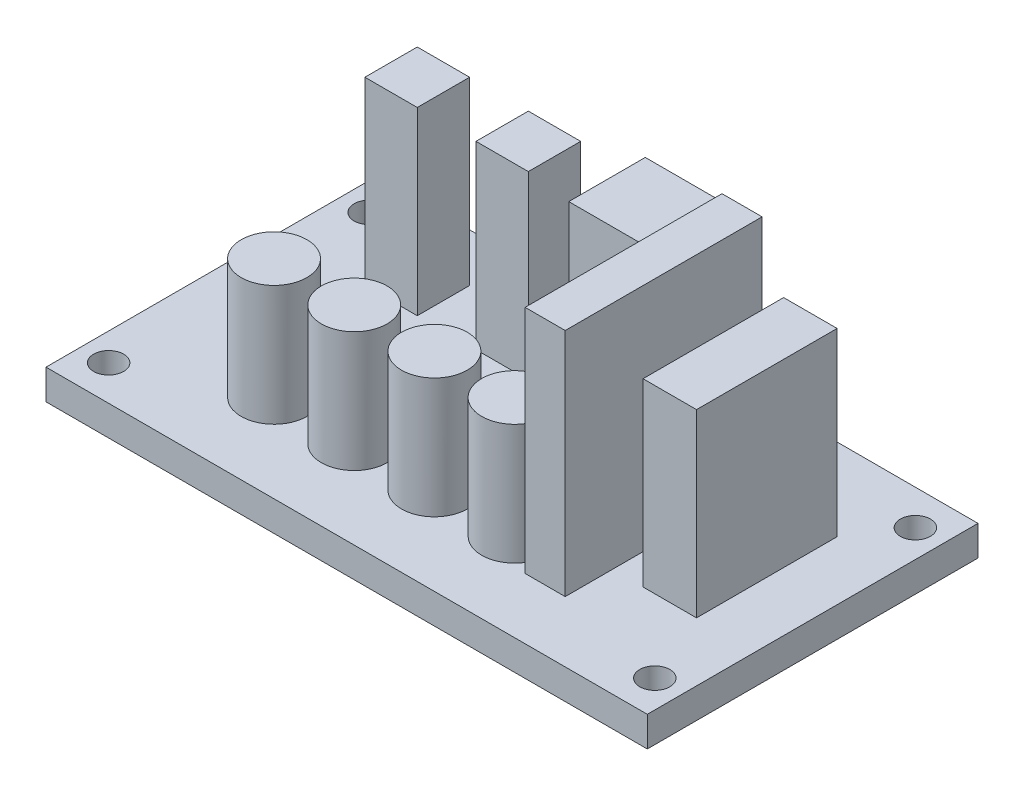
ISO-10303-21;
HEADER;
FILE_DESCRIPTION(('STEP AP214'),'2;1');
FILE_NAME('part.step','',(''),(''),'','','');
FILE_SCHEMA(('AUTOMOTIVE_DESIGN { 1 0 10303 214 1 1 1 1 }'));
ENDSEC;
DATA;
#1=APPLICATION_CONTEXT('core data for automotive mechanical design processes');
#2=APPLICATION_PROTOCOL_DEFINITION('international standard','automotive_design',2000,#1);
#3=PRODUCT_CONTEXT('',#1,'mechanical');
#4=PRODUCT('Part','Part','',(#3));
#5=PRODUCT_RELATED_PRODUCT_CATEGORY('part','',(#4));
#6=PRODUCT_DEFINITION_FORMATION('','',#4);
#7=PRODUCT_DEFINITION_CONTEXT('part definition',#1,'design');
#8=PRODUCT_DEFINITION('design','',#6,#7);
#9=PRODUCT_DEFINITION_SHAPE('','',#8);
#10=(LENGTH_UNIT() NAMED_UNIT(*) SI_UNIT(.MILLI.,.METRE.));
#11=(NAMED_UNIT(*) PLANE_ANGLE_UNIT() SI_UNIT($,.RADIAN.));
#12=(NAMED_UNIT(*) SI_UNIT($,.STERADIAN.) SOLID_ANGLE_UNIT());
#13=UNCERTAINTY_MEASURE_WITH_UNIT(LENGTH_MEASURE(1.E-05),#10,'distance_accuracy_value','');
#14=(GEOMETRIC_REPRESENTATION_CONTEXT(3) GLOBAL_UNCERTAINTY_ASSIGNED_CONTEXT((#13)) GLOBAL_UNIT_ASSIGNED_CONTEXT((#10,
#11,#12)) REPRESENTATION_CONTEXT('',''));
#15=CARTESIAN_POINT('',(0.,0.,0.));
#16=DIRECTION('',(0.,0.,1.));
#17=DIRECTION('',(1.,0.,0.));
#18=AXIS2_PLACEMENT_3D('',#15,#16,#17);
#19=CARTESIAN_POINT('',(0.,3.,-33.));
#20=DIRECTION('',(0.,-1.,0.));
#21=DIRECTION('',(0.,0.,-1.));
#22=AXIS2_PLACEMENT_3D('',#19,#20,#21);
#23=PLANE('',#22);
#24=CARTESIAN_POINT('',(38.,3.,-8.75676326373309));
#25=DIRECTION('',(0.,-1.,0.));
#26=DIRECTION('',(0.,0.,-1.));
#27=AXIS2_PLACEMENT_3D('',#24,#25,#26);
#28=CIRCLE('',#27,3.27908034810426);
#29=CARTESIAN_POINT('',(38.,3.,-12.0358436118374));
#30=VERTEX_POINT('',#29);
#31=EDGE_CURVE('E11',#30,#30,#28,.F.);
#32=ORIENTED_EDGE('',*,*,#31,.F.);
#33=EDGE_LOOP('',(#32));
#34=FACE_BOUND('',#33,.T.);
#35=CARTESIAN_POINT('',(22.,3.,-8.75676326373309));
#36=DIRECTION('',(0.,-1.,0.));
#37=DIRECTION('',(0.,0.,-1.));
#38=AXIS2_PLACEMENT_3D('',#35,#36,#37);
#39=CIRCLE('',#38,3.27908034810427);
#40=CARTESIAN_POINT('',(22.,3.,-12.0358436118374));
#41=VERTEX_POINT('',#40);
#42=EDGE_CURVE('E418',#41,#41,#39,.F.);
#43=ORIENTED_EDGE('',*,*,#42,.F.);
#44=EDGE_LOOP('',(#43));
#45=FACE_BOUND('',#44,.T.);
#46=DIRECTION('',(0.,0.,1.));
#47=VECTOR('',#46,1.);
#48=CARTESIAN_POINT('',(19.9399820026374,3.,-28.1893330684113));
#49=LINE('',#48,#47);
#50=CARTESIAN_POINT('',(19.9399820026374,3.,-28.1893330684113));
#51=VERTEX_POINT('',#50);
#52=CARTESIAN_POINT('',(19.9399820026374,3.,-22.96497794012));
#53=VERTEX_POINT('',#52);
#54=EDGE_CURVE('E229',#51,#53,#49,.T.);
#55=ORIENTED_EDGE('',*,*,#54,.F.);
#56=DIRECTION('',(-1.,0.,0.));
#57=VECTOR('',#56,1.);
#58=CARTESIAN_POINT('',(19.9399820026374,3.,-28.1893330684113));
#59=LINE('',#58,#57);
#60=CARTESIAN_POINT('',(25.1643371309287,3.,-28.1893330684113));
#61=VERTEX_POINT('',#60);
#62=EDGE_CURVE('E234',#61,#51,#59,.T.);
#63=ORIENTED_EDGE('',*,*,#62,.F.);
#64=DIRECTION('',(0.,0.,-1.));
#65=VECTOR('',#64,1.);
#66=CARTESIAN_POINT('',(25.1643371309287,3.,-28.1893330684113));
#67=LINE('',#66,#65);
#68=CARTESIAN_POINT('',(25.1643371309287,3.,-22.96497794012));
#69=VERTEX_POINT('',#68);
#70=EDGE_CURVE('E246',#69,#61,#67,.T.);
#71=ORIENTED_EDGE('',*,*,#70,.F.);
#72=DIRECTION('',(1.,0.,0.));
#73=VECTOR('',#72,1.);
#74=CARTESIAN_POINT('',(19.9399820026374,3.,-22.96497794012));
#75=LINE('',#74,#73);
#76=EDGE_CURVE('E243',#53,#69,#75,.T.);
#77=ORIENTED_EDGE('',*,*,#76,.F.);
#78=EDGE_LOOP('',(#55,#63,#71,#77));
#79=FACE_BOUND('',#78,.T.);
#80=DIRECTION('',(0.,0.,1.));
#81=VECTOR('',#80,1.);
#82=CARTESIAN_POINT('',(48.7885103903238,3.,-24.8147061126076));
#83=LINE('',#82,#81);
#84=CARTESIAN_POINT('',(48.7885103903238,3.,-24.8147061126076));
#85=VERTEX_POINT('',#84);
#86=CARTESIAN_POINT('',(48.7885103903238,3.,-10.7874044385108));
#87=VERTEX_POINT('',#86);
#88=EDGE_CURVE('E295',#85,#87,#83,.T.);
#89=ORIENTED_EDGE('',*,*,#88,.F.);
#90=DIRECTION('',(-1.,0.,0.));
#91=VECTOR('',#90,1.);
#92=CARTESIAN_POINT('',(48.7885103903238,3.,-24.8147061126076));
#93=LINE('',#92,#91);
#94=CARTESIAN_POINT('',(54.1262633456281,3.,-24.8147061126076));
#95=VERTEX_POINT('',#94);
#96=EDGE_CURVE('E300',#95,#85,#93,.T.);
#97=ORIENTED_EDGE('',*,*,#96,.F.);
#98=DIRECTION('',(0.,0.,-1.));
#99=VECTOR('',#98,1.);
#100=CARTESIAN_POINT('',(54.1262633456281,3.,-24.8147061126076));
#101=LINE('',#100,#99);
#102=CARTESIAN_POINT('',(54.1262633456281,3.,-10.7874044385108));
#103=VERTEX_POINT('',#102);
#104=EDGE_CURVE('E312',#103,#95,#101,.T.);
#105=ORIENTED_EDGE('',*,*,#104,.F.);
#106=DIRECTION('',(1.,0.,0.));
#107=VECTOR('',#106,1.);
#108=CARTESIAN_POINT('',(48.7885103903238,3.,-10.7874044385108));
#109=LINE('',#108,#107);
#110=EDGE_CURVE('E309',#87,#103,#109,.T.);
#111=ORIENTED_EDGE('',*,*,#110,.F.);
#112=EDGE_LOOP('',(#89,#97,#105,#111));
#113=FACE_BOUND('',#112,.T.);
#114=CARTESIAN_POINT('',(2.75,3.,-3.5));
#115=DIRECTION('',(0.,1.,0.));
#116=DIRECTION('',(0.,0.,-1.));
#117=AXIS2_PLACEMENT_3D('',#114,#115,#116);
#118=CIRCLE('',#117,1.5);
#119=CARTESIAN_POINT('',(2.75,3.,-5.));
#120=VERTEX_POINT('',#119);
#121=EDGE_CURVE('E362',#120,#120,#118,.T.);
#122=ORIENTED_EDGE('',*,*,#121,.F.);
#123=EDGE_LOOP('',(#122));
#124=FACE_BOUND('',#123,.T.);
#125=CARTESIAN_POINT('',(57.25,3.,-29.5));
#126=DIRECTION('',(0.,1.,0.));
#127=DIRECTION('',(0.,0.,-1.));
#128=AXIS2_PLACEMENT_3D('',#125,#126,#127);
#129=CIRCLE('',#128,1.5);
#130=CARTESIAN_POINT('',(57.25,3.,-31.));
#131=VERTEX_POINT('',#130);
#132=EDGE_CURVE('E374',#131,#131,#129,.T.);
#133=ORIENTED_EDGE('',*,*,#132,.F.);
#134=EDGE_LOOP('',(#133));
#135=FACE_BOUND('',#134,.T.);
#136=DIRECTION('',(0.,0.,1.));
#137=VECTOR('',#136,1.);
#138=CARTESIAN_POINT('',(0.,3.,0.));
#139=LINE('',#138,#137);
#140=CARTESIAN_POINT('',(0.,3.,-33.));
#141=VERTEX_POINT('',#140);
#142=CARTESIAN_POINT('',(0.,3.,0.));
#143=VERTEX_POINT('',#142);
#144=EDGE_CURVE('E386',#141,#143,#139,.T.);
#145=ORIENTED_EDGE('',*,*,#144,.T.);
#146=DIRECTION('',(1.,0.,0.));
#147=VECTOR('',#146,1.);
#148=CARTESIAN_POINT('',(0.,3.,0.));
#149=LINE('',#148,#147);
#150=CARTESIAN_POINT('',(60.,3.,0.));
#151=VERTEX_POINT('',#150);
#152=EDGE_CURVE('E389',#143,#151,#149,.T.);
#153=ORIENTED_EDGE('',*,*,#152,.T.);
#154=DIRECTION('',(0.,0.,-1.));
#155=VECTOR('',#154,1.);
#156=CARTESIAN_POINT('',(60.,3.,0.));
#157=LINE('',#156,#155);
#158=CARTESIAN_POINT('',(60.,3.,-33.));
#159=VERTEX_POINT('',#158);
#160=EDGE_CURVE('E392',#151,#159,#157,.T.);
#161=ORIENTED_EDGE('',*,*,#160,.T.);
#162=DIRECTION('',(-1.,0.,0.));
#163=VECTOR('',#162,1.);
#164=CARTESIAN_POINT('',(0.,3.,-33.));
#165=LINE('',#164,#163);
#166=EDGE_CURVE('E394',#159,#141,#165,.T.);
#167=ORIENTED_EDGE('',*,*,#166,.T.);
#168=EDGE_LOOP('',(#145,#153,#161,#167));
#169=FACE_BOUND('',#168,.T.);
#170=CARTESIAN_POINT('',(2.75,3.,-29.5));
#171=DIRECTION('',(0.,1.,0.));
#172=DIRECTION('',(0.,0.,1.));
#173=AXIS2_PLACEMENT_3D('',#170,#171,#172);
#174=CIRCLE('',#173,1.5);
#175=CARTESIAN_POINT('',(2.75,3.,-28.));
#176=VERTEX_POINT('',#175);
#177=EDGE_CURVE('E380',#176,#176,#174,.T.);
#178=ORIENTED_EDGE('',*,*,#177,.F.);
#179=EDGE_LOOP('',(#178));
#180=FACE_BOUND('',#179,.T.);
#181=CARTESIAN_POINT('',(57.25,3.,-3.50000000000001));
#182=DIRECTION('',(0.,1.,0.));
#183=DIRECTION('',(0.,0.,1.));
#184=AXIS2_PLACEMENT_3D('',#181,#182,#183);
#185=CIRCLE('',#184,1.5);
#186=CARTESIAN_POINT('',(57.25,3.,-2.00000000000001));
#187=VERTEX_POINT('',#186);
#188=EDGE_CURVE('E368',#187,#187,#185,.T.);
#189=ORIENTED_EDGE('',*,*,#188,.F.);
#190=EDGE_LOOP('',(#189));
#191=FACE_BOUND('',#190,.T.);
#192=DIRECTION('',(0.,0.,1.));
#193=VECTOR('',#192,1.);
#194=CARTESIAN_POINT('',(29.7763452337447,3.,-30.0227773688517));
#195=LINE('',#194,#193);
#196=CARTESIAN_POINT('',(29.7763452337447,3.,-30.0227773688517));
#197=VERTEX_POINT('',#196);
#198=CARTESIAN_POINT('',(29.7763452337447,3.,-22.3885755891189));
#199=VERTEX_POINT('',#198);
#200=EDGE_CURVE('E328',#197,#199,#195,.T.);
#201=ORIENTED_EDGE('',*,*,#200,.F.);
#202=DIRECTION('',(-1.,0.,0.));
#203=VECTOR('',#202,1.);
#204=CARTESIAN_POINT('',(29.7763452337447,3.,-30.0227773688517));
#205=LINE('',#204,#203);
#206=CARTESIAN_POINT('',(37.4105470134776,3.,-30.0227773688517));
#207=VERTEX_POINT('',#206);
#208=EDGE_CURVE('E333',#207,#197,#205,.T.);
#209=ORIENTED_EDGE('',*,*,#208,.F.);
#210=DIRECTION('',(0.,0.,-1.));
#211=VECTOR('',#210,1.);
#212=CARTESIAN_POINT('',(37.4105470134776,3.,-30.0227773688517));
#213=LINE('',#212,#211);
#214=CARTESIAN_POINT('',(37.4105470134776,3.,-22.3885755891189));
#215=VERTEX_POINT('',#214);
#216=EDGE_CURVE('E345',#215,#207,#213,.T.);
#217=ORIENTED_EDGE('',*,*,#216,.F.);
#218=DIRECTION('',(1.,0.,0.));
#219=VECTOR('',#218,1.);
#220=CARTESIAN_POINT('',(29.7763452337447,3.,-22.3885755891189));
#221=LINE('',#220,#219);
#222=EDGE_CURVE('E342',#199,#215,#221,.T.);
#223=ORIENTED_EDGE('',*,*,#222,.F.);
#224=EDGE_LOOP('',(#201,#209,#217,#223));
#225=FACE_BOUND('',#224,.T.);
#226=DIRECTION('',(0.,0.,1.));
#227=VECTOR('',#226,1.);
#228=CARTESIAN_POINT('',(8.85721479602886,3.,-28.1893330684113));
#229=LINE('',#228,#227);
#230=CARTESIAN_POINT('',(8.85721479602886,3.,-28.1893330684113));
#231=VERTEX_POINT('',#230);
#232=CARTESIAN_POINT('',(8.85721479602886,3.,-22.96497794012));
#233=VERTEX_POINT('',#232);
#234=EDGE_CURVE('E262',#231,#233,#229,.T.);
#235=ORIENTED_EDGE('',*,*,#234,.F.);
#236=DIRECTION('',(-1.,0.,0.));
#237=VECTOR('',#236,1.);
#238=CARTESIAN_POINT('',(8.85721479602886,3.,-28.1893330684113));
#239=LINE('',#238,#237);
#240=CARTESIAN_POINT('',(14.0815699243202,3.,-28.1893330684113));
#241=VERTEX_POINT('',#240);
#242=EDGE_CURVE('E267',#241,#231,#239,.T.);
#243=ORIENTED_EDGE('',*,*,#242,.F.);
#244=DIRECTION('',(0.,0.,-1.));
#245=VECTOR('',#244,1.);
#246=CARTESIAN_POINT('',(14.0815699243202,3.,-28.1893330684113));
#247=LINE('',#246,#245);
#248=CARTESIAN_POINT('',(14.0815699243202,3.,-22.96497794012));
#249=VERTEX_POINT('',#248);
#250=EDGE_CURVE('E279',#249,#241,#247,.T.);
#251=ORIENTED_EDGE('',*,*,#250,.F.);
#252=DIRECTION('',(1.,0.,0.));
#253=VECTOR('',#252,1.);
#254=CARTESIAN_POINT('',(8.85721479602886,3.,-22.96497794012));
#255=LINE('',#254,#253);
#256=EDGE_CURVE('E276',#233,#249,#255,.T.);
#257=ORIENTED_EDGE('',*,*,#256,.F.);
#258=EDGE_LOOP('',(#235,#243,#251,#257));
#259=FACE_BOUND('',#258,.T.);
#260=CARTESIAN_POINT('',(14.,3.,-8.75676326373309));
#261=DIRECTION('',(0.,-1.,0.));
#262=DIRECTION('',(0.,0.,-1.));
#263=AXIS2_PLACEMENT_3D('',#260,#261,#262);
#264=CIRCLE('',#263,3.27908034810427);
#265=CARTESIAN_POINT('',(14.,3.,-12.0358436118374));
#266=VERTEX_POINT('',#265);
#267=EDGE_CURVE('E415',#266,#266,#264,.F.);
#268=ORIENTED_EDGE('',*,*,#267,.F.);
#269=EDGE_LOOP('',(#268));
#270=FACE_BOUND('',#269,.T.);
#271=CARTESIAN_POINT('',(30.,3.,-8.75676326373309));
#272=DIRECTION('',(0.,-1.,0.));
#273=DIRECTION('',(0.,0.,-1.));
#274=AXIS2_PLACEMENT_3D('',#271,#272,#273);
#275=CIRCLE('',#274,3.27908034810426);
#276=CARTESIAN_POINT('',(30.,3.,-12.0358436118374));
#277=VERTEX_POINT('',#276);
#278=EDGE_CURVE('E38',#277,#277,#275,.F.);
#279=ORIENTED_EDGE('',*,*,#278,.F.);
#280=EDGE_LOOP('',(#279));
#281=FACE_BOUND('',#280,.T.);
#282=DIRECTION('',(0.,0.,1.));
#283=VECTOR('',#282,1.);
#284=CARTESIAN_POINT('',(41.7374555393621,3.,-25.7183290557066));
#285=LINE('',#284,#283);
#286=CARTESIAN_POINT('',(41.7374555393621,3.,-25.7183290557066));
#287=VERTEX_POINT('',#286);
#288=CARTESIAN_POINT('',(41.7374555393621,3.,-6.07222956749354));
#289=VERTEX_POINT('',#288);
#290=EDGE_CURVE('E211',#287,#289,#285,.T.);
#291=ORIENTED_EDGE('',*,*,#290,.F.);
#292=DIRECTION('',(-1.,0.,0.));
#293=VECTOR('',#292,1.);
#294=CARTESIAN_POINT('',(41.7374555393621,3.,-25.7183290557066));
#295=LINE('',#294,#293);
#296=CARTESIAN_POINT('',(45.7374555393621,3.,-25.7183290557066));
#297=VERTEX_POINT('',#296);
#298=EDGE_CURVE('E208',#297,#287,#295,.T.);
#299=ORIENTED_EDGE('',*,*,#298,.F.);
#300=DIRECTION('',(0.,0.,-1.));
#301=VECTOR('',#300,1.);
#302=CARTESIAN_POINT('',(45.7374555393621,3.,-25.7183290557066));
#303=LINE('',#302,#301);
#304=CARTESIAN_POINT('',(45.7374555393621,3.,-6.07222956749354));
#305=VERTEX_POINT('',#304);
#306=EDGE_CURVE('E50',#305,#297,#303,.T.);
#307=ORIENTED_EDGE('',*,*,#306,.F.);
#308=DIRECTION('',(1.,0.,0.));
#309=VECTOR('',#308,1.);
#310=CARTESIAN_POINT('',(41.7374555393621,3.,-6.07222956749354));
#311=LINE('',#310,#309);
#312=EDGE_CURVE('E45',#289,#305,#311,.T.);
#313=ORIENTED_EDGE('',*,*,#312,.F.);
#314=EDGE_LOOP('',(#291,#299,#307,#313));
#315=FACE_BOUND('',#314,.T.);
#316=ADVANCED_FACE('F30',(#34,#45,#79,#113,#124,#135,#169,#180,#191,#225,#259,#270,#281,#315),
#23,.F.);
#317=CARTESIAN_POINT('',(0.,0.,-33.));
#318=DIRECTION('',(0.,-1.,0.));
#319=DIRECTION('',(0.,0.,-1.));
#320=AXIS2_PLACEMENT_3D('',#317,#318,#319);
#321=PLANE('',#320);
#322=CARTESIAN_POINT('',(57.25,0.,-3.50000000000001));
#323=DIRECTION('',(0.,1.,0.));
#324=DIRECTION('',(0.,0.,1.));
#325=AXIS2_PLACEMENT_3D('',#322,#323,#324);
#326=CIRCLE('',#325,1.5);
#327=CARTESIAN_POINT('',(57.25,0.,-2.00000000000001));
#328=VERTEX_POINT('',#327);
#329=EDGE_CURVE('E365',#328,#328,#326,.T.);
#330=ORIENTED_EDGE('',*,*,#329,.T.);
#331=EDGE_LOOP('',(#330));
#332=FACE_BOUND('',#331,.T.);
#333=CARTESIAN_POINT('',(2.75,0.,-29.5));
#334=DIRECTION('',(0.,1.,0.));
#335=DIRECTION('',(0.,0.,1.));
#336=AXIS2_PLACEMENT_3D('',#333,#334,#335);
#337=CIRCLE('',#336,1.5);
#338=CARTESIAN_POINT('',(2.75,0.,-28.));
#339=VERTEX_POINT('',#338);
#340=EDGE_CURVE('E377',#339,#339,#337,.T.);
#341=ORIENTED_EDGE('',*,*,#340,.T.);
#342=EDGE_LOOP('',(#341));
#343=FACE_BOUND('',#342,.T.);
#344=DIRECTION('',(0.,0.,1.));
#345=VECTOR('',#344,1.);
#346=CARTESIAN_POINT('',(0.,0.,0.));
#347=LINE('',#346,#345);
#348=CARTESIAN_POINT('',(0.,0.,-33.));
#349=VERTEX_POINT('',#348);
#350=CARTESIAN_POINT('',(0.,0.,0.));
#351=VERTEX_POINT('',#350);
#352=EDGE_CURVE('E383',#349,#351,#347,.T.);
#353=ORIENTED_EDGE('',*,*,#352,.F.);
#354=DIRECTION('',(-1.,0.,0.));
#355=VECTOR('',#354,1.);
#356=CARTESIAN_POINT('',(0.,0.,-33.));
#357=LINE('',#356,#355);
#358=CARTESIAN_POINT('',(60.,0.,-33.));
#359=VERTEX_POINT('',#358);
#360=EDGE_CURVE('E390',#359,#349,#357,.T.);
#361=ORIENTED_EDGE('',*,*,#360,.F.);
#362=DIRECTION('',(0.,0.,-1.));
#363=VECTOR('',#362,1.);
#364=CARTESIAN_POINT('',(60.,0.,0.));
#365=LINE('',#364,#363);
#366=CARTESIAN_POINT('',(60.,0.,0.));
#367=VERTEX_POINT('',#366);
#368=EDGE_CURVE('E401',#367,#359,#365,.T.);
#369=ORIENTED_EDGE('',*,*,#368,.F.);
#370=DIRECTION('',(1.,0.,0.));
#371=VECTOR('',#370,1.);
#372=CARTESIAN_POINT('',(0.,0.,0.));
#373=LINE('',#372,#371);
#374=EDGE_CURVE('E399',#351,#367,#373,.T.);
#375=ORIENTED_EDGE('',*,*,#374,.F.);
#376=EDGE_LOOP('',(#353,#361,#369,#375));
#377=FACE_BOUND('',#376,.T.);
#378=CARTESIAN_POINT('',(57.25,0.,-29.5));
#379=DIRECTION('',(0.,1.,0.));
#380=DIRECTION('',(0.,0.,-1.));
#381=AXIS2_PLACEMENT_3D('',#378,#379,#380);
#382=CIRCLE('',#381,1.5);
#383=CARTESIAN_POINT('',(57.25,0.,-31.));
#384=VERTEX_POINT('',#383);
#385=EDGE_CURVE('E371',#384,#384,#382,.T.);
#386=ORIENTED_EDGE('',*,*,#385,.T.);
#387=EDGE_LOOP('',(#386));
#388=FACE_BOUND('',#387,.T.);
#389=CARTESIAN_POINT('',(2.75,0.,-3.5));
#390=DIRECTION('',(0.,1.,0.));
#391=DIRECTION('',(0.,0.,-1.));
#392=AXIS2_PLACEMENT_3D('',#389,#390,#391);
#393=CIRCLE('',#392,1.5);
#394=CARTESIAN_POINT('',(2.75,0.,-5.));
#395=VERTEX_POINT('',#394);
#396=EDGE_CURVE('E361',#395,#395,#393,.T.);
#397=ORIENTED_EDGE('',*,*,#396,.T.);
#398=EDGE_LOOP('',(#397));
#399=FACE_BOUND('',#398,.T.);
#400=ADVANCED_FACE('F426',(#332,#343,#377,#388,#399),#321,.T.);
#401=CARTESIAN_POINT('',(0.,3.,0.));
#402=DIRECTION('',(1.,0.,0.));
#403=DIRECTION('',(0.,0.,-1.));
#404=AXIS2_PLACEMENT_3D('',#401,#402,#403);
#405=PLANE('',#404);
#406=ORIENTED_EDGE('',*,*,#352,.T.);
#407=DIRECTION('',(0.,-1.,0.));
#408=VECTOR('',#407,1.);
#409=CARTESIAN_POINT('',(0.,3.,0.));
#410=LINE('',#409,#408);
#411=EDGE_CURVE('E412',#143,#351,#410,.T.);
#412=ORIENTED_EDGE('',*,*,#411,.F.);
#413=ORIENTED_EDGE('',*,*,#144,.F.);
#414=DIRECTION('',(0.,-1.,0.));
#415=VECTOR('',#414,1.);
#416=CARTESIAN_POINT('',(0.,3.,-33.));
#417=LINE('',#416,#415);
#418=EDGE_CURVE('E396',#141,#349,#417,.T.);
#419=ORIENTED_EDGE('',*,*,#418,.T.);
#420=EDGE_LOOP('',(#406,#412,#413,#419));
#421=FACE_BOUND('',#420,.T.);
#422=ADVANCED_FACE('F32',(#421),#405,.F.);
#423=CARTESIAN_POINT('',(0.,3.,0.));
#424=DIRECTION('',(0.,0.,-1.));
#425=DIRECTION('',(-1.,0.,0.));
#426=AXIS2_PLACEMENT_3D('',#423,#424,#425);
#427=PLANE('',#426);
#428=ORIENTED_EDGE('',*,*,#374,.T.);
#429=DIRECTION('',(0.,-1.,0.));
#430=VECTOR('',#429,1.);
#431=CARTESIAN_POINT('',(60.,3.,0.));
#432=LINE('',#431,#430);
#433=EDGE_CURVE('E409',#151,#367,#432,.T.);
#434=ORIENTED_EDGE('',*,*,#433,.F.);
#435=ORIENTED_EDGE('',*,*,#152,.F.);
#436=ORIENTED_EDGE('',*,*,#411,.T.);
#437=EDGE_LOOP('',(#428,#434,#435,#436));
#438=FACE_BOUND('',#437,.T.);
#439=ADVANCED_FACE('F592',(#438),#427,.F.);
#440=CARTESIAN_POINT('',(60.,3.,0.));
#441=DIRECTION('',(-1.,0.,0.));
#442=DIRECTION('',(0.,0.,1.));
#443=AXIS2_PLACEMENT_3D('',#440,#441,#442);
#444=PLANE('',#443);
#445=ORIENTED_EDGE('',*,*,#368,.T.);
#446=DIRECTION('',(0.,-1.,0.));
#447=VECTOR('',#446,1.);
#448=CARTESIAN_POINT('',(60.,3.,-33.));
#449=LINE('',#448,#447);
#450=EDGE_CURVE('E406',#159,#359,#449,.T.);
#451=ORIENTED_EDGE('',*,*,#450,.F.);
#452=ORIENTED_EDGE('',*,*,#160,.F.);
#453=ORIENTED_EDGE('',*,*,#433,.T.);
#454=EDGE_LOOP('',(#445,#451,#452,#453));
#455=FACE_BOUND('',#454,.T.);
#456=ADVANCED_FACE('F589',(#455),#444,.F.);
#457=CARTESIAN_POINT('',(0.,3.,-33.));
#458=DIRECTION('',(0.,0.,1.));
#459=DIRECTION('',(1.,0.,0.));
#460=AXIS2_PLACEMENT_3D('',#457,#458,#459);
#461=PLANE('',#460);
#462=ORIENTED_EDGE('',*,*,#360,.T.);
#463=ORIENTED_EDGE('',*,*,#418,.F.);
#464=ORIENTED_EDGE('',*,*,#166,.F.);
#465=ORIENTED_EDGE('',*,*,#450,.T.);
#466=EDGE_LOOP('',(#462,#463,#464,#465));
#467=FACE_BOUND('',#466,.T.);
#468=ADVANCED_FACE('F581',(#467),#461,.F.);
#469=CARTESIAN_POINT('',(2.75,3.,-29.5));
#470=DIRECTION('',(0.,-1.,0.));
#471=DIRECTION('',(0.,0.,-1.));
#472=AXIS2_PLACEMENT_3D('',#469,#470,#471);
#473=CYLINDRICAL_SURFACE('',#472,1.5);
#474=ORIENTED_EDGE('',*,*,#177,.T.);
#475=EDGE_LOOP('',(#474));
#476=FACE_BOUND('',#475,.T.);
#477=ORIENTED_EDGE('',*,*,#340,.F.);
#478=EDGE_LOOP('',(#477));
#479=FACE_BOUND('',#478,.T.);
#480=ADVANCED_FACE('F578',(#476,#479),#473,.F.);
#481=CARTESIAN_POINT('',(57.25,3.,-29.5));
#482=DIRECTION('',(0.,-1.,0.));
#483=DIRECTION('',(0.,0.,-1.));
#484=AXIS2_PLACEMENT_3D('',#481,#482,#483);
#485=CYLINDRICAL_SURFACE('',#484,1.5);
#486=ORIENTED_EDGE('',*,*,#132,.T.);
#487=EDGE_LOOP('',(#486));
#488=FACE_BOUND('',#487,.T.);
#489=ORIENTED_EDGE('',*,*,#385,.F.);
#490=EDGE_LOOP('',(#489));
#491=FACE_BOUND('',#490,.T.);
#492=ADVANCED_FACE('F574',(#488,#491),#485,.F.);
#493=CARTESIAN_POINT('',(57.25,3.,-3.50000000000001));
#494=DIRECTION('',(0.,-1.,0.));
#495=DIRECTION('',(0.,0.,-1.));
#496=AXIS2_PLACEMENT_3D('',#493,#494,#495);
#497=CYLINDRICAL_SURFACE('',#496,1.5);
#498=ORIENTED_EDGE('',*,*,#188,.T.);
#499=EDGE_LOOP('',(#498));
#500=FACE_BOUND('',#499,.T.);
#501=ORIENTED_EDGE('',*,*,#329,.F.);
#502=EDGE_LOOP('',(#501));
#503=FACE_BOUND('',#502,.T.);
#504=ADVANCED_FACE('F570',(#500,#503),#497,.F.);
#505=CARTESIAN_POINT('',(2.75,3.,-3.5));
#506=DIRECTION('',(0.,-1.,0.));
#507=DIRECTION('',(0.,0.,-1.));
#508=AXIS2_PLACEMENT_3D('',#505,#506,#507);
#509=CYLINDRICAL_SURFACE('',#508,1.5);
#510=ORIENTED_EDGE('',*,*,#121,.T.);
#511=EDGE_LOOP('',(#510));
#512=FACE_BOUND('',#511,.T.);
#513=ORIENTED_EDGE('',*,*,#396,.F.);
#514=EDGE_LOOP('',(#513));
#515=FACE_BOUND('',#514,.T.);
#516=ADVANCED_FACE('F566',(#512,#515),#509,.F.);
#517=CARTESIAN_POINT('',(29.7763452337447,21.,-30.0227773688517));
#518=DIRECTION('',(1.,0.,0.));
#519=DIRECTION('',(0.,0.,-1.));
#520=AXIS2_PLACEMENT_3D('',#517,#518,#519);
#521=PLANE('',#520);
#522=ORIENTED_EDGE('',*,*,#200,.T.);
#523=DIRECTION('',(0.,-1.,0.));
#524=VECTOR('',#523,1.);
#525=CARTESIAN_POINT('',(29.7763452337447,21.,-22.3885755891189));
#526=LINE('',#525,#524);
#527=CARTESIAN_POINT('',(29.7763452337447,21.,-22.3885755891189));
#528=VERTEX_POINT('',#527);
#529=EDGE_CURVE('E358',#528,#199,#526,.T.);
#530=ORIENTED_EDGE('',*,*,#529,.F.);
#531=DIRECTION('',(0.,0.,1.));
#532=VECTOR('',#531,1.);
#533=CARTESIAN_POINT('',(29.7763452337447,21.,-30.0227773688517));
#534=LINE('',#533,#532);
#535=CARTESIAN_POINT('',(29.7763452337447,21.,-30.0227773688517));
#536=VERTEX_POINT('',#535);
#537=EDGE_CURVE('E329',#536,#528,#534,.T.);
#538=ORIENTED_EDGE('',*,*,#537,.F.);
#539=DIRECTION('',(0.,-1.,0.));
#540=VECTOR('',#539,1.);
#541=CARTESIAN_POINT('',(29.7763452337447,21.,-30.0227773688517));
#542=LINE('',#541,#540);
#543=EDGE_CURVE('E339',#536,#197,#542,.T.);
#544=ORIENTED_EDGE('',*,*,#543,.T.);
#545=EDGE_LOOP('',(#522,#530,#538,#544));
#546=FACE_BOUND('',#545,.T.);
#547=ADVANCED_FACE('F562',(#546),#521,.F.);
#548=CARTESIAN_POINT('',(29.7763452337447,21.,-22.3885755891189));
#549=DIRECTION('',(0.,0.,-1.));
#550=DIRECTION('',(-1.,0.,0.));
#551=AXIS2_PLACEMENT_3D('',#548,#549,#550);
#552=PLANE('',#551);
#553=ORIENTED_EDGE('',*,*,#222,.T.);
#554=DIRECTION('',(0.,-1.,0.));
#555=VECTOR('',#554,1.);
#556=CARTESIAN_POINT('',(37.4105470134776,21.,-22.3885755891189));
#557=LINE('',#556,#555);
#558=CARTESIAN_POINT('',(37.4105470134776,21.,-22.3885755891189));
#559=VERTEX_POINT('',#558);
#560=EDGE_CURVE('E355',#559,#215,#557,.T.);
#561=ORIENTED_EDGE('',*,*,#560,.F.);
#562=DIRECTION('',(1.,0.,0.));
#563=VECTOR('',#562,1.);
#564=CARTESIAN_POINT('',(29.7763452337447,21.,-22.3885755891189));
#565=LINE('',#564,#563);
#566=EDGE_CURVE('E332',#528,#559,#565,.T.);
#567=ORIENTED_EDGE('',*,*,#566,.F.);
#568=ORIENTED_EDGE('',*,*,#529,.T.);
#569=EDGE_LOOP('',(#553,#561,#567,#568));
#570=FACE_BOUND('',#569,.T.);
#571=ADVANCED_FACE('F558',(#570),#552,.F.);
#572=CARTESIAN_POINT('',(37.4105470134776,21.,-30.0227773688517));
#573=DIRECTION('',(-1.,0.,0.));
#574=DIRECTION('',(0.,0.,1.));
#575=AXIS2_PLACEMENT_3D('',#572,#573,#574);
#576=PLANE('',#575);
#577=ORIENTED_EDGE('',*,*,#216,.T.);
#578=DIRECTION('',(0.,-1.,0.));
#579=VECTOR('',#578,1.);
#580=CARTESIAN_POINT('',(37.4105470134776,21.,-30.0227773688517));
#581=LINE('',#580,#579);
#582=CARTESIAN_POINT('',(37.4105470134776,21.,-30.0227773688517));
#583=VERTEX_POINT('',#582);
#584=EDGE_CURVE('E352',#583,#207,#581,.T.);
#585=ORIENTED_EDGE('',*,*,#584,.F.);
#586=DIRECTION('',(0.,0.,-1.));
#587=VECTOR('',#586,1.);
#588=CARTESIAN_POINT('',(37.4105470134776,21.,-30.0227773688517));
#589=LINE('',#588,#587);
#590=EDGE_CURVE('E335',#559,#583,#589,.T.);
#591=ORIENTED_EDGE('',*,*,#590,.F.);
#592=ORIENTED_EDGE('',*,*,#560,.T.);
#593=EDGE_LOOP('',(#577,#585,#591,#592));
#594=FACE_BOUND('',#593,.T.);
#595=ADVANCED_FACE('F554',(#594),#576,.F.);
#596=CARTESIAN_POINT('',(29.7763452337447,21.,-30.0227773688517));
#597=DIRECTION('',(0.,0.,1.));
#598=DIRECTION('',(1.,0.,0.));
#599=AXIS2_PLACEMENT_3D('',#596,#597,#598);
#600=PLANE('',#599);
#601=ORIENTED_EDGE('',*,*,#208,.T.);
#602=ORIENTED_EDGE('',*,*,#543,.F.);
#603=DIRECTION('',(-1.,0.,0.));
#604=VECTOR('',#603,1.);
#605=CARTESIAN_POINT('',(29.7763452337447,21.,-30.0227773688517));
#606=LINE('',#605,#604);
#607=EDGE_CURVE('E337',#583,#536,#606,.T.);
#608=ORIENTED_EDGE('',*,*,#607,.F.);
#609=ORIENTED_EDGE('',*,*,#584,.T.);
#610=EDGE_LOOP('',(#601,#602,#608,#609));
#611=FACE_BOUND('',#610,.T.);
#612=ADVANCED_FACE('F550',(#611),#600,.F.);
#613=CARTESIAN_POINT('',(29.7763452337447,21.,-22.3885755891189));
#614=DIRECTION('',(0.,1.,0.));
#615=DIRECTION('',(0.,0.,1.));
#616=AXIS2_PLACEMENT_3D('',#613,#614,#615);
#617=PLANE('',#616);
#618=ORIENTED_EDGE('',*,*,#537,.T.);
#619=ORIENTED_EDGE('',*,*,#566,.T.);
#620=ORIENTED_EDGE('',*,*,#590,.T.);
#621=ORIENTED_EDGE('',*,*,#607,.T.);
#622=EDGE_LOOP('',(#618,#619,#620,#621));
#623=FACE_BOUND('',#622,.T.);
#624=ADVANCED_FACE('F546',(#623),#617,.T.);
#625=CARTESIAN_POINT('',(48.7885103903238,21.,-24.8147061126076));
#626=DIRECTION('',(1.,0.,0.));
#627=DIRECTION('',(0.,0.,-1.));
#628=AXIS2_PLACEMENT_3D('',#625,#626,#627);
#629=PLANE('',#628);
#630=ORIENTED_EDGE('',*,*,#88,.T.);
#631=DIRECTION('',(0.,-1.,0.));
#632=VECTOR('',#631,1.);
#633=CARTESIAN_POINT('',(48.7885103903238,21.,-10.7874044385108));
#634=LINE('',#633,#632);
#635=CARTESIAN_POINT('',(48.7885103903238,21.,-10.7874044385108));
#636=VERTEX_POINT('',#635);
#637=EDGE_CURVE('E325',#636,#87,#634,.T.);
#638=ORIENTED_EDGE('',*,*,#637,.F.);
#639=DIRECTION('',(0.,0.,1.));
#640=VECTOR('',#639,1.);
#641=CARTESIAN_POINT('',(48.7885103903238,21.,-24.8147061126076));
#642=LINE('',#641,#640);
#643=CARTESIAN_POINT('',(48.7885103903238,21.,-24.8147061126076));
#644=VERTEX_POINT('',#643);
#645=EDGE_CURVE('E296',#644,#636,#642,.T.);
#646=ORIENTED_EDGE('',*,*,#645,.F.);
#647=DIRECTION('',(0.,-1.,0.));
#648=VECTOR('',#647,1.);
#649=CARTESIAN_POINT('',(48.7885103903238,21.,-24.8147061126076));
#650=LINE('',#649,#648);
#651=EDGE_CURVE('E306',#644,#85,#650,.T.);
#652=ORIENTED_EDGE('',*,*,#651,.T.);
#653=EDGE_LOOP('',(#630,#638,#646,#652));
#654=FACE_BOUND('',#653,.T.);
#655=ADVANCED_FACE('F542',(#654),#629,.F.);
#656=CARTESIAN_POINT('',(48.7885103903238,21.,-10.7874044385108));
#657=DIRECTION('',(0.,0.,-1.));
#658=DIRECTION('',(-1.,0.,0.));
#659=AXIS2_PLACEMENT_3D('',#656,#657,#658);
#660=PLANE('',#659);
#661=ORIENTED_EDGE('',*,*,#110,.T.);
#662=DIRECTION('',(0.,-1.,0.));
#663=VECTOR('',#662,1.);
#664=CARTESIAN_POINT('',(54.1262633456281,21.,-10.7874044385108));
#665=LINE('',#664,#663);
#666=CARTESIAN_POINT('',(54.1262633456281,21.,-10.7874044385108));
#667=VERTEX_POINT('',#666);
#668=EDGE_CURVE('E322',#667,#103,#665,.T.);
#669=ORIENTED_EDGE('',*,*,#668,.F.);
#670=DIRECTION('',(1.,0.,0.));
#671=VECTOR('',#670,1.);
#672=CARTESIAN_POINT('',(48.7885103903238,21.,-10.7874044385108));
#673=LINE('',#672,#671);
#674=EDGE_CURVE('E299',#636,#667,#673,.T.);
#675=ORIENTED_EDGE('',*,*,#674,.F.);
#676=ORIENTED_EDGE('',*,*,#637,.T.);
#677=EDGE_LOOP('',(#661,#669,#675,#676));
#678=FACE_BOUND('',#677,.T.);
#679=ADVANCED_FACE('F538',(#678),#660,.F.);
#680=CARTESIAN_POINT('',(54.1262633456281,21.,-24.8147061126076));
#681=DIRECTION('',(-1.,0.,0.));
#682=DIRECTION('',(0.,0.,1.));
#683=AXIS2_PLACEMENT_3D('',#680,#681,#682);
#684=PLANE('',#683);
#685=ORIENTED_EDGE('',*,*,#104,.T.);
#686=DIRECTION('',(0.,-1.,0.));
#687=VECTOR('',#686,1.);
#688=CARTESIAN_POINT('',(54.1262633456281,21.,-24.8147061126076));
#689=LINE('',#688,#687);
#690=CARTESIAN_POINT('',(54.1262633456281,21.,-24.8147061126076));
#691=VERTEX_POINT('',#690);
#692=EDGE_CURVE('E319',#691,#95,#689,.T.);
#693=ORIENTED_EDGE('',*,*,#692,.F.);
#694=DIRECTION('',(0.,0.,-1.));
#695=VECTOR('',#694,1.);
#696=CARTESIAN_POINT('',(54.1262633456281,21.,-24.8147061126076));
#697=LINE('',#696,#695);
#698=EDGE_CURVE('E302',#667,#691,#697,.T.);
#699=ORIENTED_EDGE('',*,*,#698,.F.);
#700=ORIENTED_EDGE('',*,*,#668,.T.);
#701=EDGE_LOOP('',(#685,#693,#699,#700));
#702=FACE_BOUND('',#701,.T.);
#703=ADVANCED_FACE('F534',(#702),#684,.F.);
#704=CARTESIAN_POINT('',(48.7885103903238,21.,-24.8147061126076));
#705=DIRECTION('',(0.,0.,1.));
#706=DIRECTION('',(1.,0.,0.));
#707=AXIS2_PLACEMENT_3D('',#704,#705,#706);
#708=PLANE('',#707);
#709=ORIENTED_EDGE('',*,*,#96,.T.);
#710=ORIENTED_EDGE('',*,*,#651,.F.);
#711=DIRECTION('',(-1.,0.,0.));
#712=VECTOR('',#711,1.);
#713=CARTESIAN_POINT('',(48.7885103903238,21.,-24.8147061126076));
#714=LINE('',#713,#712);
#715=EDGE_CURVE('E304',#691,#644,#714,.T.);
#716=ORIENTED_EDGE('',*,*,#715,.F.);
#717=ORIENTED_EDGE('',*,*,#692,.T.);
#718=EDGE_LOOP('',(#709,#710,#716,#717));
#719=FACE_BOUND('',#718,.T.);
#720=ADVANCED_FACE('F530',(#719),#708,.F.);
#721=CARTESIAN_POINT('',(48.7885103903238,21.,-10.7874044385108));
#722=DIRECTION('',(0.,1.,0.));
#723=DIRECTION('',(0.,0.,1.));
#724=AXIS2_PLACEMENT_3D('',#721,#722,#723);
#725=PLANE('',#724);
#726=ORIENTED_EDGE('',*,*,#645,.T.);
#727=ORIENTED_EDGE('',*,*,#674,.T.);
#728=ORIENTED_EDGE('',*,*,#698,.T.);
#729=ORIENTED_EDGE('',*,*,#715,.T.);
#730=EDGE_LOOP('',(#726,#727,#728,#729));
#731=FACE_BOUND('',#730,.T.);
#732=ADVANCED_FACE('F526',(#731),#725,.T.);
#733=CARTESIAN_POINT('',(8.85721479602886,21.,-28.1893330684113));
#734=DIRECTION('',(1.,0.,0.));
#735=DIRECTION('',(0.,0.,-1.));
#736=AXIS2_PLACEMENT_3D('',#733,#734,#735);
#737=PLANE('',#736);
#738=ORIENTED_EDGE('',*,*,#234,.T.);
#739=DIRECTION('',(0.,-1.,0.));
#740=VECTOR('',#739,1.);
#741=CARTESIAN_POINT('',(8.85721479602886,21.,-22.96497794012));
#742=LINE('',#741,#740);
#743=CARTESIAN_POINT('',(8.85721479602886,21.,-22.96497794012));
#744=VERTEX_POINT('',#743);
#745=EDGE_CURVE('E292',#744,#233,#742,.T.);
#746=ORIENTED_EDGE('',*,*,#745,.F.);
#747=DIRECTION('',(0.,0.,1.));
#748=VECTOR('',#747,1.);
#749=CARTESIAN_POINT('',(8.85721479602886,21.,-28.1893330684113));
#750=LINE('',#749,#748);
#751=CARTESIAN_POINT('',(8.85721479602886,21.,-28.1893330684113));
#752=VERTEX_POINT('',#751);
#753=EDGE_CURVE('E263',#752,#744,#750,.T.);
#754=ORIENTED_EDGE('',*,*,#753,.F.);
#755=DIRECTION('',(0.,-1.,0.));
#756=VECTOR('',#755,1.);
#757=CARTESIAN_POINT('',(8.85721479602886,21.,-28.1893330684113));
#758=LINE('',#757,#756);
#759=EDGE_CURVE('E273',#752,#231,#758,.T.);
#760=ORIENTED_EDGE('',*,*,#759,.T.);
#761=EDGE_LOOP('',(#738,#746,#754,#760));
#762=FACE_BOUND('',#761,.T.);
#763=ADVANCED_FACE('F522',(#762),#737,.F.);
#764=CARTESIAN_POINT('',(8.85721479602886,21.,-22.96497794012));
#765=DIRECTION('',(0.,0.,-1.));
#766=DIRECTION('',(-1.,0.,0.));
#767=AXIS2_PLACEMENT_3D('',#764,#765,#766);
#768=PLANE('',#767);
#769=ORIENTED_EDGE('',*,*,#256,.T.);
#770=DIRECTION('',(0.,-1.,0.));
#771=VECTOR('',#770,1.);
#772=CARTESIAN_POINT('',(14.0815699243202,21.,-22.96497794012));
#773=LINE('',#772,#771);
#774=CARTESIAN_POINT('',(14.0815699243202,21.,-22.96497794012));
#775=VERTEX_POINT('',#774);
#776=EDGE_CURVE('E289',#775,#249,#773,.T.);
#777=ORIENTED_EDGE('',*,*,#776,.F.);
#778=DIRECTION('',(1.,0.,0.));
#779=VECTOR('',#778,1.);
#780=CARTESIAN_POINT('',(8.85721479602886,21.,-22.96497794012));
#781=LINE('',#780,#779);
#782=EDGE_CURVE('E266',#744,#775,#781,.T.);
#783=ORIENTED_EDGE('',*,*,#782,.F.);
#784=ORIENTED_EDGE('',*,*,#745,.T.);
#785=EDGE_LOOP('',(#769,#777,#783,#784));
#786=FACE_BOUND('',#785,.T.);
#787=ADVANCED_FACE('F518',(#786),#768,.F.);
#788=CARTESIAN_POINT('',(14.0815699243202,21.,-28.1893330684113));
#789=DIRECTION('',(-1.,0.,0.));
#790=DIRECTION('',(0.,0.,1.));
#791=AXIS2_PLACEMENT_3D('',#788,#789,#790);
#792=PLANE('',#791);
#793=ORIENTED_EDGE('',*,*,#250,.T.);
#794=DIRECTION('',(0.,-1.,0.));
#795=VECTOR('',#794,1.);
#796=CARTESIAN_POINT('',(14.0815699243202,21.,-28.1893330684113));
#797=LINE('',#796,#795);
#798=CARTESIAN_POINT('',(14.0815699243202,21.,-28.1893330684113));
#799=VERTEX_POINT('',#798);
#800=EDGE_CURVE('E286',#799,#241,#797,.T.);
#801=ORIENTED_EDGE('',*,*,#800,.F.);
#802=DIRECTION('',(0.,0.,-1.));
#803=VECTOR('',#802,1.);
#804=CARTESIAN_POINT('',(14.0815699243202,21.,-28.1893330684113));
#805=LINE('',#804,#803);
#806=EDGE_CURVE('E269',#775,#799,#805,.T.);
#807=ORIENTED_EDGE('',*,*,#806,.F.);
#808=ORIENTED_EDGE('',*,*,#776,.T.);
#809=EDGE_LOOP('',(#793,#801,#807,#808));
#810=FACE_BOUND('',#809,.T.);
#811=ADVANCED_FACE('F514',(#810),#792,.F.);
#812=CARTESIAN_POINT('',(8.85721479602886,21.,-28.1893330684113));
#813=DIRECTION('',(0.,0.,1.));
#814=DIRECTION('',(1.,0.,0.));
#815=AXIS2_PLACEMENT_3D('',#812,#813,#814);
#816=PLANE('',#815);
#817=ORIENTED_EDGE('',*,*,#242,.T.);
#818=ORIENTED_EDGE('',*,*,#759,.F.);
#819=DIRECTION('',(-1.,0.,0.));
#820=VECTOR('',#819,1.);
#821=CARTESIAN_POINT('',(8.85721479602886,21.,-28.1893330684113));
#822=LINE('',#821,#820);
#823=EDGE_CURVE('E271',#799,#752,#822,.T.);
#824=ORIENTED_EDGE('',*,*,#823,.F.);
#825=ORIENTED_EDGE('',*,*,#800,.T.);
#826=EDGE_LOOP('',(#817,#818,#824,#825));
#827=FACE_BOUND('',#826,.T.);
#828=ADVANCED_FACE('F510',(#827),#816,.F.);
#829=CARTESIAN_POINT('',(8.85721479602886,21.,-22.96497794012));
#830=DIRECTION('',(0.,1.,0.));
#831=DIRECTION('',(0.,0.,1.));
#832=AXIS2_PLACEMENT_3D('',#829,#830,#831);
#833=PLANE('',#832);
#834=ORIENTED_EDGE('',*,*,#753,.T.);
#835=ORIENTED_EDGE('',*,*,#782,.T.);
#836=ORIENTED_EDGE('',*,*,#806,.T.);
#837=ORIENTED_EDGE('',*,*,#823,.T.);
#838=EDGE_LOOP('',(#834,#835,#836,#837));
#839=FACE_BOUND('',#838,.T.);
#840=ADVANCED_FACE('F506',(#839),#833,.T.);
#841=CARTESIAN_POINT('',(19.9399820026374,21.,-28.1893330684113));
#842=DIRECTION('',(1.,0.,0.));
#843=DIRECTION('',(0.,0.,-1.));
#844=AXIS2_PLACEMENT_3D('',#841,#842,#843);
#845=PLANE('',#844);
#846=ORIENTED_EDGE('',*,*,#54,.T.);
#847=DIRECTION('',(0.,-1.,0.));
#848=VECTOR('',#847,1.);
#849=CARTESIAN_POINT('',(19.9399820026374,21.,-22.96497794012));
#850=LINE('',#849,#848);
#851=CARTESIAN_POINT('',(19.9399820026374,21.,-22.96497794012));
#852=VERTEX_POINT('',#851);
#853=EDGE_CURVE('E259',#852,#53,#850,.T.);
#854=ORIENTED_EDGE('',*,*,#853,.F.);
#855=DIRECTION('',(0.,0.,1.));
#856=VECTOR('',#855,1.);
#857=CARTESIAN_POINT('',(19.9399820026374,21.,-28.1893330684113));
#858=LINE('',#857,#856);
#859=CARTESIAN_POINT('',(19.9399820026374,21.,-28.1893330684113));
#860=VERTEX_POINT('',#859);
#861=EDGE_CURVE('E230',#860,#852,#858,.T.);
#862=ORIENTED_EDGE('',*,*,#861,.F.);
#863=DIRECTION('',(0.,-1.,0.));
#864=VECTOR('',#863,1.);
#865=CARTESIAN_POINT('',(19.9399820026374,21.,-28.1893330684113));
#866=LINE('',#865,#864);
#867=EDGE_CURVE('E240',#860,#51,#866,.T.);
#868=ORIENTED_EDGE('',*,*,#867,.T.);
#869=EDGE_LOOP('',(#846,#854,#862,#868));
#870=FACE_BOUND('',#869,.T.);
#871=ADVANCED_FACE('F502',(#870),#845,.F.);
#872=CARTESIAN_POINT('',(19.9399820026374,21.,-22.96497794012));
#873=DIRECTION('',(0.,0.,-1.));
#874=DIRECTION('',(-1.,0.,0.));
#875=AXIS2_PLACEMENT_3D('',#872,#873,#874);
#876=PLANE('',#875);
#877=ORIENTED_EDGE('',*,*,#76,.T.);
#878=DIRECTION('',(0.,-1.,0.));
#879=VECTOR('',#878,1.);
#880=CARTESIAN_POINT('',(25.1643371309287,21.,-22.96497794012));
#881=LINE('',#880,#879);
#882=CARTESIAN_POINT('',(25.1643371309287,21.,-22.96497794012));
#883=VERTEX_POINT('',#882);
#884=EDGE_CURVE('E256',#883,#69,#881,.T.);
#885=ORIENTED_EDGE('',*,*,#884,.F.);
#886=DIRECTION('',(1.,0.,0.));
#887=VECTOR('',#886,1.);
#888=CARTESIAN_POINT('',(19.9399820026374,21.,-22.96497794012));
#889=LINE('',#888,#887);
#890=EDGE_CURVE('E233',#852,#883,#889,.T.);
#891=ORIENTED_EDGE('',*,*,#890,.F.);
#892=ORIENTED_EDGE('',*,*,#853,.T.);
#893=EDGE_LOOP('',(#877,#885,#891,#892));
#894=FACE_BOUND('',#893,.T.);
#895=ADVANCED_FACE('F498',(#894),#876,.F.);
#896=CARTESIAN_POINT('',(25.1643371309287,21.,-28.1893330684113));
#897=DIRECTION('',(-1.,0.,0.));
#898=DIRECTION('',(0.,0.,1.));
#899=AXIS2_PLACEMENT_3D('',#896,#897,#898);
#900=PLANE('',#899);
#901=ORIENTED_EDGE('',*,*,#70,.T.);
#902=DIRECTION('',(0.,-1.,0.));
#903=VECTOR('',#902,1.);
#904=CARTESIAN_POINT('',(25.1643371309287,21.,-28.1893330684113));
#905=LINE('',#904,#903);
#906=CARTESIAN_POINT('',(25.1643371309287,21.,-28.1893330684113));
#907=VERTEX_POINT('',#906);
#908=EDGE_CURVE('E253',#907,#61,#905,.T.);
#909=ORIENTED_EDGE('',*,*,#908,.F.);
#910=DIRECTION('',(0.,0.,-1.));
#911=VECTOR('',#910,1.);
#912=CARTESIAN_POINT('',(25.1643371309287,21.,-28.1893330684113));
#913=LINE('',#912,#911);
#914=EDGE_CURVE('E236',#883,#907,#913,.T.);
#915=ORIENTED_EDGE('',*,*,#914,.F.);
#916=ORIENTED_EDGE('',*,*,#884,.T.);
#917=EDGE_LOOP('',(#901,#909,#915,#916));
#918=FACE_BOUND('',#917,.T.);
#919=ADVANCED_FACE('F494',(#918),#900,.F.);
#920=CARTESIAN_POINT('',(19.9399820026374,21.,-28.1893330684113));
#921=DIRECTION('',(0.,0.,1.));
#922=DIRECTION('',(1.,0.,0.));
#923=AXIS2_PLACEMENT_3D('',#920,#921,#922);
#924=PLANE('',#923);
#925=ORIENTED_EDGE('',*,*,#62,.T.);
#926=ORIENTED_EDGE('',*,*,#867,.F.);
#927=DIRECTION('',(-1.,0.,0.));
#928=VECTOR('',#927,1.);
#929=CARTESIAN_POINT('',(19.9399820026374,21.,-28.1893330684113));
#930=LINE('',#929,#928);
#931=EDGE_CURVE('E238',#907,#860,#930,.T.);
#932=ORIENTED_EDGE('',*,*,#931,.F.);
#933=ORIENTED_EDGE('',*,*,#908,.T.);
#934=EDGE_LOOP('',(#925,#926,#932,#933));
#935=FACE_BOUND('',#934,.T.);
#936=ADVANCED_FACE('F490',(#935),#924,.F.);
#937=CARTESIAN_POINT('',(19.9399820026374,21.,-22.96497794012));
#938=DIRECTION('',(0.,1.,0.));
#939=DIRECTION('',(0.,0.,1.));
#940=AXIS2_PLACEMENT_3D('',#937,#938,#939);
#941=PLANE('',#940);
#942=ORIENTED_EDGE('',*,*,#861,.T.);
#943=ORIENTED_EDGE('',*,*,#890,.T.);
#944=ORIENTED_EDGE('',*,*,#914,.T.);
#945=ORIENTED_EDGE('',*,*,#931,.T.);
#946=EDGE_LOOP('',(#942,#943,#944,#945));
#947=FACE_BOUND('',#946,.T.);
#948=ADVANCED_FACE('F486',(#947),#941,.T.);
#949=CARTESIAN_POINT('',(14.,15.,-8.75676326373309));
#950=DIRECTION('',(0.,-1.,0.));
#951=DIRECTION('',(0.,0.,-1.));
#952=AXIS2_PLACEMENT_3D('',#949,#950,#951);
#953=CYLINDRICAL_SURFACE('',#952,3.27908034810427);
#954=CARTESIAN_POINT('',(14.,15.,-8.75676326373309));
#955=DIRECTION('',(0.,1.,0.));
#956=DIRECTION('',(0.,0.,1.));
#957=AXIS2_PLACEMENT_3D('',#954,#955,#956);
#958=CIRCLE('',#957,3.27908034810427);
#959=CARTESIAN_POINT('',(14.,15.,-5.47768291562883));
#960=VERTEX_POINT('',#959);
#961=EDGE_CURVE('E226',#960,#960,#958,.T.);
#962=ORIENTED_EDGE('',*,*,#961,.F.);
#963=EDGE_LOOP('',(#962));
#964=FACE_BOUND('',#963,.T.);
#965=ORIENTED_EDGE('',*,*,#267,.T.);
#966=EDGE_LOOP('',(#965));
#967=FACE_BOUND('',#966,.T.);
#968=ADVANCED_FACE('F482',(#964,#967),#953,.T.);
#969=CARTESIAN_POINT('',(14.,15.,-8.75676326373309));
#970=DIRECTION('',(0.,1.,0.));
#971=DIRECTION('',(0.,0.,1.));
#972=AXIS2_PLACEMENT_3D('',#969,#970,#971);
#973=PLANE('',#972);
#974=ORIENTED_EDGE('',*,*,#961,.T.);
#975=EDGE_LOOP('',(#974));
#976=FACE_BOUND('',#975,.T.);
#977=ADVANCED_FACE('F478',(#976),#973,.T.);
#978=CARTESIAN_POINT('',(22.,15.,-8.75676326373309));
#979=DIRECTION('',(0.,-1.,0.));
#980=DIRECTION('',(0.,0.,-1.));
#981=AXIS2_PLACEMENT_3D('',#978,#979,#980);
#982=CYLINDRICAL_SURFACE('',#981,3.27908034810427);
#983=CARTESIAN_POINT('',(22.,15.,-8.75676326373309));
#984=DIRECTION('',(0.,1.,0.));
#985=DIRECTION('',(0.,0.,1.));
#986=AXIS2_PLACEMENT_3D('',#983,#984,#985);
#987=CIRCLE('',#986,3.27908034810427);
#988=CARTESIAN_POINT('',(22.,15.,-5.47768291562883));
#989=VERTEX_POINT('',#988);
#990=EDGE_CURVE('E223',#989,#989,#987,.T.);
#991=ORIENTED_EDGE('',*,*,#990,.F.);
#992=EDGE_LOOP('',(#991));
#993=FACE_BOUND('',#992,.T.);
#994=ORIENTED_EDGE('',*,*,#42,.T.);
#995=EDGE_LOOP('',(#994));
#996=FACE_BOUND('',#995,.T.);
#997=ADVANCED_FACE('F474',(#993,#996),#982,.T.);
#998=CARTESIAN_POINT('',(22.,15.,-8.75676326373309));
#999=DIRECTION('',(0.,1.,0.));
#1000=DIRECTION('',(0.,0.,1.));
#1001=AXIS2_PLACEMENT_3D('',#998,#999,#1000);
#1002=PLANE('',#1001);
#1003=ORIENTED_EDGE('',*,*,#990,.T.);
#1004=EDGE_LOOP('',(#1003));
#1005=FACE_BOUND('',#1004,.T.);
#1006=ADVANCED_FACE('F470',(#1005),#1002,.T.);
#1007=CARTESIAN_POINT('',(30.,15.,-8.75676326373309));
#1008=DIRECTION('',(0.,-1.,0.));
#1009=DIRECTION('',(0.,0.,-1.));
#1010=AXIS2_PLACEMENT_3D('',#1007,#1008,#1009);
#1011=CYLINDRICAL_SURFACE('',#1010,3.27908034810426);
#1012=CARTESIAN_POINT('',(30.,15.,-8.75676326373309));
#1013=DIRECTION('',(0.,1.,0.));
#1014=DIRECTION('',(0.,0.,1.));
#1015=AXIS2_PLACEMENT_3D('',#1012,#1013,#1014);
#1016=CIRCLE('',#1015,3.27908034810426);
#1017=CARTESIAN_POINT('',(30.,15.,-5.47768291562883));
#1018=VERTEX_POINT('',#1017);
#1019=EDGE_CURVE('E215',#1018,#1018,#1016,.T.);
#1020=ORIENTED_EDGE('',*,*,#1019,.F.);
#1021=EDGE_LOOP('',(#1020));
#1022=FACE_BOUND('',#1021,.T.);
#1023=ORIENTED_EDGE('',*,*,#278,.T.);
#1024=EDGE_LOOP('',(#1023));
#1025=FACE_BOUND('',#1024,.T.);
#1026=ADVANCED_FACE('F423',(#1022,#1025),#1011,.T.);
#1027=CARTESIAN_POINT('',(30.,15.,-8.75676326373309));
#1028=DIRECTION('',(0.,1.,0.));
#1029=DIRECTION('',(0.,0.,1.));
#1030=AXIS2_PLACEMENT_3D('',#1027,#1028,#1029);
#1031=PLANE('',#1030);
#1032=ORIENTED_EDGE('',*,*,#1019,.T.);
#1033=EDGE_LOOP('',(#1032));
#1034=FACE_BOUND('',#1033,.T.);
#1035=ADVANCED_FACE('F463',(#1034),#1031,.T.);
#1036=CARTESIAN_POINT('',(38.,15.,-8.75676326373309));
#1037=DIRECTION('',(0.,-1.,0.));
#1038=DIRECTION('',(0.,0.,-1.));
#1039=AXIS2_PLACEMENT_3D('',#1036,#1037,#1038);
#1040=CYLINDRICAL_SURFACE('',#1039,3.27908034810426);
#1041=CARTESIAN_POINT('',(38.,15.,-8.75676326373309));
#1042=DIRECTION('',(0.,1.,0.));
#1043=DIRECTION('',(0.,0.,1.));
#1044=AXIS2_PLACEMENT_3D('',#1041,#1042,#1043);
#1045=CIRCLE('',#1044,3.27908034810426);
#1046=CARTESIAN_POINT('',(38.,15.,-5.47768291562883));
#1047=VERTEX_POINT('',#1046);
#1048=EDGE_CURVE('E212',#1047,#1047,#1045,.T.);
#1049=ORIENTED_EDGE('',*,*,#1048,.F.);
#1050=EDGE_LOOP('',(#1049));
#1051=FACE_BOUND('',#1050,.T.);
#1052=ORIENTED_EDGE('',*,*,#31,.T.);
#1053=EDGE_LOOP('',(#1052));
#1054=FACE_BOUND('',#1053,.T.);
#1055=ADVANCED_FACE('F459',(#1051,#1054),#1040,.T.);
#1056=CARTESIAN_POINT('',(38.,15.,-8.75676326373309));
#1057=DIRECTION('',(0.,1.,0.));
#1058=DIRECTION('',(0.,0.,1.));
#1059=AXIS2_PLACEMENT_3D('',#1056,#1057,#1058);
#1060=PLANE('',#1059);
#1061=ORIENTED_EDGE('',*,*,#1048,.T.);
#1062=EDGE_LOOP('',(#1061));
#1063=FACE_BOUND('',#1062,.T.);
#1064=ADVANCED_FACE('F456',(#1063),#1060,.T.);
#1065=CARTESIAN_POINT('',(41.7374555393621,26.,-25.7183290557066));
#1066=DIRECTION('',(1.,0.,0.));
#1067=DIRECTION('',(0.,0.,-1.));
#1068=AXIS2_PLACEMENT_3D('',#1065,#1066,#1067);
#1069=PLANE('',#1068);
#1070=ORIENTED_EDGE('',*,*,#290,.T.);
#1071=DIRECTION('',(0.,-1.,0.));
#1072=VECTOR('',#1071,1.);
#1073=CARTESIAN_POINT('',(41.7374555393621,26.,-6.07222956749354));
#1074=LINE('',#1073,#1072);
#1075=CARTESIAN_POINT('',(41.7374555393621,26.,-6.07222956749354));
#1076=VERTEX_POINT('',#1075);
#1077=EDGE_CURVE('E192',#1076,#289,#1074,.T.);
#1078=ORIENTED_EDGE('',*,*,#1077,.F.);
#1079=DIRECTION('',(0.,0.,1.));
#1080=VECTOR('',#1079,1.);
#1081=CARTESIAN_POINT('',(41.7374555393621,26.,-25.7183290557066));
#1082=LINE('',#1081,#1080);
#1083=CARTESIAN_POINT('',(41.7374555393621,26.,-25.7183290557066));
#1084=VERTEX_POINT('',#1083);
#1085=EDGE_CURVE('E199',#1084,#1076,#1082,.T.);
#1086=ORIENTED_EDGE('',*,*,#1085,.F.);
#1087=DIRECTION('',(0.,-1.,0.));
#1088=VECTOR('',#1087,1.);
#1089=CARTESIAN_POINT('',(41.7374555393621,26.,-25.7183290557066));
#1090=LINE('',#1089,#1088);
#1091=EDGE_CURVE('E434',#1084,#287,#1090,.T.);
#1092=ORIENTED_EDGE('',*,*,#1091,.T.);
#1093=EDGE_LOOP('',(#1070,#1078,#1086,#1092));
#1094=FACE_BOUND('',#1093,.T.);
#1095=ADVANCED_FACE('F210',(#1094),#1069,.F.);
#1096=CARTESIAN_POINT('',(41.7374555393621,26.,-6.07222956749354));
#1097=DIRECTION('',(0.,0.,-1.));
#1098=DIRECTION('',(-1.,0.,0.));
#1099=AXIS2_PLACEMENT_3D('',#1096,#1097,#1098);
#1100=PLANE('',#1099);
#1101=ORIENTED_EDGE('',*,*,#312,.T.);
#1102=DIRECTION('',(0.,-1.,0.));
#1103=VECTOR('',#1102,1.);
#1104=CARTESIAN_POINT('',(45.7374555393621,26.,-6.07222956749354));
#1105=LINE('',#1104,#1103);
#1106=CARTESIAN_POINT('',(45.7374555393621,26.,-6.07222956749354));
#1107=VERTEX_POINT('',#1106);
#1108=EDGE_CURVE('E195',#1107,#305,#1105,.T.);
#1109=ORIENTED_EDGE('',*,*,#1108,.F.);
#1110=DIRECTION('',(1.,0.,0.));
#1111=VECTOR('',#1110,1.);
#1112=CARTESIAN_POINT('',(41.7374555393621,26.,-6.07222956749354));
#1113=LINE('',#1112,#1111);
#1114=EDGE_CURVE('E188',#1076,#1107,#1113,.T.);
#1115=ORIENTED_EDGE('',*,*,#1114,.F.);
#1116=ORIENTED_EDGE('',*,*,#1077,.T.);
#1117=EDGE_LOOP('',(#1101,#1109,#1115,#1116));
#1118=FACE_BOUND('',#1117,.T.);
#1119=ADVANCED_FACE('F190',(#1118),#1100,.F.);
#1120=CARTESIAN_POINT('',(45.7374555393621,26.,-25.7183290557066));
#1121=DIRECTION('',(-1.,0.,0.));
#1122=DIRECTION('',(0.,0.,1.));
#1123=AXIS2_PLACEMENT_3D('',#1120,#1121,#1122);
#1124=PLANE('',#1123);
#1125=ORIENTED_EDGE('',*,*,#306,.T.);
#1126=DIRECTION('',(0.,-1.,0.));
#1127=VECTOR('',#1126,1.);
#1128=CARTESIAN_POINT('',(45.7374555393621,26.,-25.7183290557066));
#1129=LINE('',#1128,#1127);
#1130=CARTESIAN_POINT('',(45.7374555393621,26.,-25.7183290557066));
#1131=VERTEX_POINT('',#1130);
#1132=EDGE_CURVE('E217',#1131,#297,#1129,.T.);
#1133=ORIENTED_EDGE('',*,*,#1132,.F.);
#1134=DIRECTION('',(0.,0.,-1.));
#1135=VECTOR('',#1134,1.);
#1136=CARTESIAN_POINT('',(45.7374555393621,26.,-25.7183290557066));
#1137=LINE('',#1136,#1135);
#1138=EDGE_CURVE('E198',#1107,#1131,#1137,.T.);
#1139=ORIENTED_EDGE('',*,*,#1138,.F.);
#1140=ORIENTED_EDGE('',*,*,#1108,.T.);
#1141=EDGE_LOOP('',(#1125,#1133,#1139,#1140));
#1142=FACE_BOUND('',#1141,.T.);
#1143=ADVANCED_FACE('F443',(#1142),#1124,.F.);
#1144=CARTESIAN_POINT('',(41.7374555393621,26.,-25.7183290557066));
#1145=DIRECTION('',(0.,0.,1.));
#1146=DIRECTION('',(1.,0.,0.));
#1147=AXIS2_PLACEMENT_3D('',#1144,#1145,#1146);
#1148=PLANE('',#1147);
#1149=ORIENTED_EDGE('',*,*,#298,.T.);
#1150=ORIENTED_EDGE('',*,*,#1091,.F.);
#1151=DIRECTION('',(-1.,0.,0.));
#1152=VECTOR('',#1151,1.);
#1153=CARTESIAN_POINT('',(41.7374555393621,26.,-25.7183290557066));
#1154=LINE('',#1153,#1152);
#1155=EDGE_CURVE('E204',#1131,#1084,#1154,.T.);
#1156=ORIENTED_EDGE('',*,*,#1155,.F.);
#1157=ORIENTED_EDGE('',*,*,#1132,.T.);
#1158=EDGE_LOOP('',(#1149,#1150,#1156,#1157));
#1159=FACE_BOUND('',#1158,.T.);
#1160=ADVANCED_FACE('F433',(#1159),#1148,.F.);
#1161=CARTESIAN_POINT('',(41.7374555393621,26.,-6.07222956749354));
#1162=DIRECTION('',(0.,1.,0.));
#1163=DIRECTION('',(0.,0.,1.));
#1164=AXIS2_PLACEMENT_3D('',#1161,#1162,#1163);
#1165=PLANE('',#1164);
#1166=ORIENTED_EDGE('',*,*,#1085,.T.);
#1167=ORIENTED_EDGE('',*,*,#1114,.T.);
#1168=ORIENTED_EDGE('',*,*,#1138,.T.);
#1169=ORIENTED_EDGE('',*,*,#1155,.T.);
#1170=EDGE_LOOP('',(#1166,#1167,#1168,#1169));
#1171=FACE_BOUND('',#1170,.T.);
#1172=ADVANCED_FACE('F202',(#1171),#1165,.T.);
#1173=CLOSED_SHELL('',(#316,#400,#422,#439,#456,#468,#480,#492,#504,#516,#547,#571,#595,#612,
#624,#655,#679,#703,#720,#732,#763,#787,#811,#828,#840,#871,#895,#919,#936,#948,#968,#977,#997,
#1006,#1026,#1035,#1055,#1064,#1095,#1119,#1143,#1160,#1172));
#1174=MANIFOLD_SOLID_BREP('B2',#1173);
#1175=ADVANCED_BREP_SHAPE_REPRESENTATION('',(#18,#1174),#14);
#1176=SHAPE_DEFINITION_REPRESENTATION(#9,#1175);
ENDSEC;
END-ISO-10303-21;
